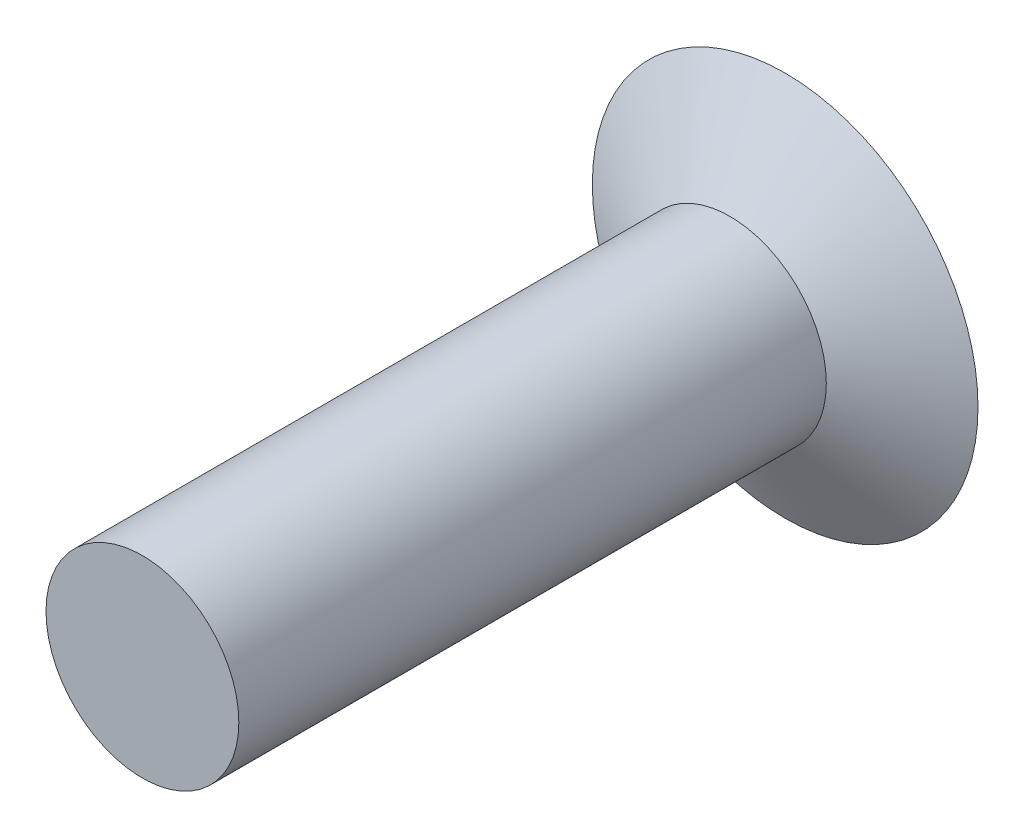
ISO-10303-21;
HEADER;
FILE_DESCRIPTION(('STEP AP214'),'2;1');
FILE_NAME('part.step','',(''),(''),'','','');
FILE_SCHEMA(('AUTOMOTIVE_DESIGN { 1 0 10303 214 1 1 1 1 }'));
ENDSEC;
DATA;
#1=APPLICATION_CONTEXT('core data for automotive mechanical design processes');
#2=APPLICATION_PROTOCOL_DEFINITION('international standard','automotive_design',2000,#1);
#3=PRODUCT_CONTEXT('',#1,'mechanical');
#4=PRODUCT('Part','Part','',(#3));
#5=PRODUCT_RELATED_PRODUCT_CATEGORY('part','',(#4));
#6=PRODUCT_DEFINITION_FORMATION('','',#4);
#7=PRODUCT_DEFINITION_CONTEXT('part definition',#1,'design');
#8=PRODUCT_DEFINITION('design','',#6,#7);
#9=PRODUCT_DEFINITION_SHAPE('','',#8);
#10=(LENGTH_UNIT() NAMED_UNIT(*) SI_UNIT(.MILLI.,.METRE.));
#11=(NAMED_UNIT(*) PLANE_ANGLE_UNIT() SI_UNIT($,.RADIAN.));
#12=(NAMED_UNIT(*) SI_UNIT($,.STERADIAN.) SOLID_ANGLE_UNIT());
#13=UNCERTAINTY_MEASURE_WITH_UNIT(LENGTH_MEASURE(1.E-05),#10,'distance_accuracy_value','');
#14=(GEOMETRIC_REPRESENTATION_CONTEXT(3) GLOBAL_UNCERTAINTY_ASSIGNED_CONTEXT((#13)) GLOBAL_UNIT_ASSIGNED_CONTEXT((#10,
#11,#12)) REPRESENTATION_CONTEXT('',''));
#15=CARTESIAN_POINT('',(0.,0.,0.));
#16=DIRECTION('',(0.,0.,1.));
#17=DIRECTION('',(1.,0.,0.));
#18=AXIS2_PLACEMENT_3D('',#15,#16,#17);
#19=CARTESIAN_POINT('',(0.,0.,10.));
#20=DIRECTION('',(0.,0.,-1.));
#21=DIRECTION('',(-1.,0.,0.));
#22=AXIS2_PLACEMENT_3D('',#19,#20,#21);
#23=PLANE('',#22);
#24=CARTESIAN_POINT('',(0.,0.,10.));
#25=DIRECTION('',(0.,0.,-1.));
#26=DIRECTION('',(-1.,0.,0.));
#27=AXIS2_PLACEMENT_3D('',#24,#25,#26);
#28=CIRCLE('',#27,1.5);
#29=CARTESIAN_POINT('',(-1.5,0.,10.));
#30=VERTEX_POINT('',#29);
#31=EDGE_CURVE('E9',#30,#30,#28,.T.);
#32=ORIENTED_EDGE('',*,*,#31,.F.);
#33=EDGE_LOOP('',(#32));
#34=FACE_BOUND('',#33,.T.);
#35=ADVANCED_FACE('F14',(#34),#23,.F.);
#36=CARTESIAN_POINT('',(0.,0.,0.));
#37=DIRECTION('',(0.,0.,-1.));
#38=DIRECTION('',(-1.,0.,0.));
#39=AXIS2_PLACEMENT_3D('',#36,#37,#38);
#40=CYLINDRICAL_SURFACE('',#39,1.5);
#41=CARTESIAN_POINT('',(0.,0.,0.86));
#42=DIRECTION('',(0.,0.,-1.));
#43=DIRECTION('',(-1.,0.,0.));
#44=AXIS2_PLACEMENT_3D('',#41,#42,#43);
#45=CIRCLE('',#44,1.5);
#46=CARTESIAN_POINT('',(-1.5,0.,0.86));
#47=VERTEX_POINT('',#46);
#48=EDGE_CURVE('E21',#47,#47,#45,.T.);
#49=ORIENTED_EDGE('',*,*,#48,.F.);
#50=EDGE_LOOP('',(#49));
#51=FACE_BOUND('',#50,.T.);
#52=ORIENTED_EDGE('',*,*,#31,.T.);
#53=EDGE_LOOP('',(#52));
#54=FACE_BOUND('',#53,.T.);
#55=ADVANCED_FACE('F46',(#51,#54),#40,.T.);
#56=CARTESIAN_POINT('',(0.,0.,0.86));
#57=DIRECTION('',(0.,0.,-1.));
#58=DIRECTION('',(-1.,0.,0.));
#59=AXIS2_PLACEMENT_3D('',#56,#57,#58);
#60=CONICAL_SURFACE('',#59,1.5,1.05021549330324);
#61=CARTESIAN_POINT('',(0.,0.,0.));
#62=DIRECTION('',(0.,0.,-1.));
#63=DIRECTION('',(-1.,0.,0.));
#64=AXIS2_PLACEMENT_3D('',#61,#62,#63);
#65=CIRCLE('',#64,3.);
#66=CARTESIAN_POINT('',(-3.,0.,0.));
#67=VERTEX_POINT('',#66);
#68=EDGE_CURVE('E30',#67,#67,#65,.T.);
#69=ORIENTED_EDGE('',*,*,#68,.F.);
#70=EDGE_LOOP('',(#69));
#71=FACE_BOUND('',#70,.T.);
#72=ORIENTED_EDGE('',*,*,#48,.T.);
#73=EDGE_LOOP('',(#72));
#74=FACE_BOUND('',#73,.T.);
#75=ADVANCED_FACE('F44',(#71,#74),#60,.T.);
#76=CARTESIAN_POINT('',(0.,3.,0.));
#77=DIRECTION('',(0.,0.,1.));
#78=DIRECTION('',(1.,0.,0.));
#79=AXIS2_PLACEMENT_3D('',#76,#77,#78);
#80=PLANE('',#79);
#81=ORIENTED_EDGE('',*,*,#68,.T.);
#82=EDGE_LOOP('',(#81));
#83=FACE_BOUND('',#82,.T.);
#84=ADVANCED_FACE('F42',(#83),#80,.F.);
#85=CLOSED_SHELL('',(#35,#55,#75,#84));
#86=MANIFOLD_SOLID_BREP('B1',#85);
#87=ADVANCED_BREP_SHAPE_REPRESENTATION('',(#18,#86),#14);
#88=SHAPE_DEFINITION_REPRESENTATION(#9,#87);
ENDSEC;
END-ISO-10303-21;
